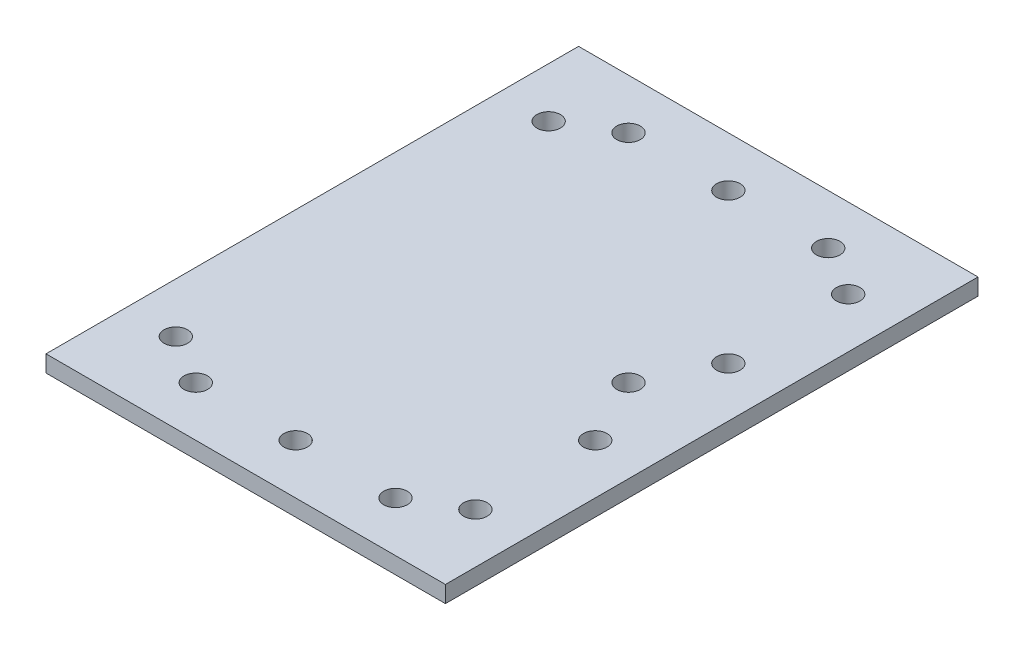
ISO-10303-21;
HEADER;
FILE_DESCRIPTION(('STEP AP214'),'2;1');
FILE_NAME('part.step','',(''),(''),'','','');
FILE_SCHEMA(('AUTOMOTIVE_DESIGN { 1 0 10303 214 1 1 1 1 }'));
ENDSEC;
DATA;
#1=APPLICATION_CONTEXT('core data for automotive mechanical design processes');
#2=APPLICATION_PROTOCOL_DEFINITION('international standard','automotive_design',2000,#1);
#3=PRODUCT_CONTEXT('',#1,'mechanical');
#4=PRODUCT('Part','Part','',(#3));
#5=PRODUCT_RELATED_PRODUCT_CATEGORY('part','',(#4));
#6=PRODUCT_DEFINITION_FORMATION('','',#4);
#7=PRODUCT_DEFINITION_CONTEXT('part definition',#1,'design');
#8=PRODUCT_DEFINITION('design','',#6,#7);
#9=PRODUCT_DEFINITION_SHAPE('','',#8);
#10=(LENGTH_UNIT() NAMED_UNIT(*) SI_UNIT(.MILLI.,.METRE.));
#11=(NAMED_UNIT(*) PLANE_ANGLE_UNIT() SI_UNIT($,.RADIAN.));
#12=(NAMED_UNIT(*) SI_UNIT($,.STERADIAN.) SOLID_ANGLE_UNIT());
#13=UNCERTAINTY_MEASURE_WITH_UNIT(LENGTH_MEASURE(1.E-05),#10,'distance_accuracy_value','');
#14=(GEOMETRIC_REPRESENTATION_CONTEXT(3) GLOBAL_UNCERTAINTY_ASSIGNED_CONTEXT((#13)) GLOBAL_UNIT_ASSIGNED_CONTEXT((#10,
#11,#12)) REPRESENTATION_CONTEXT('',''));
#15=CARTESIAN_POINT('',(0.,0.,0.));
#16=DIRECTION('',(0.,0.,1.));
#17=DIRECTION('',(1.,0.,0.));
#18=AXIS2_PLACEMENT_3D('',#15,#16,#17);
#19=CARTESIAN_POINT('',(0.,3.175,0.));
#20=DIRECTION('',(0.,-1.,0.));
#21=DIRECTION('',(0.,0.,-1.));
#22=AXIS2_PLACEMENT_3D('',#19,#20,#21);
#23=PLANE('',#22);
#24=DIRECTION('',(0.,0.,1.));
#25=VECTOR('',#24,1.);
#26=CARTESIAN_POINT('',(-38.1,3.175,-50.8));
#27=LINE('',#26,#25);
#28=CARTESIAN_POINT('',(-38.1,3.175,-50.8));
#29=VERTEX_POINT('',#28);
#30=CARTESIAN_POINT('',(-38.1,3.175,50.8));
#31=VERTEX_POINT('',#30);
#32=EDGE_CURVE('E89',#29,#31,#27,.T.);
#33=ORIENTED_EDGE('',*,*,#32,.T.);
#34=DIRECTION('',(1.,0.,0.));
#35=VECTOR('',#34,1.);
#36=CARTESIAN_POINT('',(38.1,3.175,50.8));
#37=LINE('',#36,#35);
#38=CARTESIAN_POINT('',(38.1,3.175,50.8));
#39=VERTEX_POINT('',#38);
#40=EDGE_CURVE('E84',#31,#39,#37,.T.);
#41=ORIENTED_EDGE('',*,*,#40,.T.);
#42=DIRECTION('',(0.,0.,-1.));
#43=VECTOR('',#42,1.);
#44=CARTESIAN_POINT('',(38.1,3.175,-50.8));
#45=LINE('',#44,#43);
#46=CARTESIAN_POINT('',(38.1,3.175,-50.8));
#47=VERTEX_POINT('',#46);
#48=EDGE_CURVE('E87',#39,#47,#45,.T.);
#49=ORIENTED_EDGE('',*,*,#48,.T.);
#50=DIRECTION('',(-1.,0.,0.));
#51=VECTOR('',#50,1.);
#52=CARTESIAN_POINT('',(38.1,3.175,-50.8));
#53=LINE('',#52,#51);
#54=EDGE_CURVE('E54',#47,#29,#53,.T.);
#55=ORIENTED_EDGE('',*,*,#54,.T.);
#56=EDGE_LOOP('',(#33,#41,#49,#55));
#57=FACE_BOUND('',#56,.T.);
#58=CARTESIAN_POINT('',(-19.05,3.175,41.275));
#59=DIRECTION('',(0.,1.,0.));
#60=DIRECTION('',(0.,0.,1.));
#61=AXIS2_PLACEMENT_3D('',#58,#59,#60);
#62=CIRCLE('',#61,2.25);
#63=CARTESIAN_POINT('',(-19.05,3.175,43.525));
#64=VERTEX_POINT('',#63);
#65=EDGE_CURVE('E104',#64,#64,#62,.T.);
#66=ORIENTED_EDGE('',*,*,#65,.F.);
#67=EDGE_LOOP('',(#66));
#68=FACE_BOUND('',#67,.T.);
#69=CARTESIAN_POINT('',(19.05,3.175,41.275));
#70=DIRECTION('',(0.,1.,0.));
#71=DIRECTION('',(0.,0.,1.));
#72=AXIS2_PLACEMENT_3D('',#69,#70,#71);
#73=CIRCLE('',#72,2.25);
#74=CARTESIAN_POINT('',(19.05,3.175,43.525));
#75=VERTEX_POINT('',#74);
#76=EDGE_CURVE('E119',#75,#75,#73,.T.);
#77=ORIENTED_EDGE('',*,*,#76,.F.);
#78=EDGE_LOOP('',(#77));
#79=FACE_BOUND('',#78,.T.);
#80=CARTESIAN_POINT('',(28.575,3.175,35.56));
#81=DIRECTION('',(0.,1.,0.));
#82=DIRECTION('',(0.,0.,1.));
#83=AXIS2_PLACEMENT_3D('',#80,#81,#82);
#84=CIRCLE('',#83,2.25);
#85=CARTESIAN_POINT('',(28.575,3.175,37.81));
#86=VERTEX_POINT('',#85);
#87=EDGE_CURVE('E125',#86,#86,#84,.T.);
#88=ORIENTED_EDGE('',*,*,#87,.F.);
#89=EDGE_LOOP('',(#88));
#90=FACE_BOUND('',#89,.T.);
#91=CARTESIAN_POINT('',(-28.575,3.175,35.56));
#92=DIRECTION('',(0.,1.,0.));
#93=DIRECTION('',(0.,0.,1.));
#94=AXIS2_PLACEMENT_3D('',#91,#92,#93);
#95=CIRCLE('',#94,2.25);
#96=CARTESIAN_POINT('',(-28.575,3.175,37.81));
#97=VERTEX_POINT('',#96);
#98=EDGE_CURVE('E131',#97,#97,#95,.T.);
#99=ORIENTED_EDGE('',*,*,#98,.F.);
#100=EDGE_LOOP('',(#99));
#101=FACE_BOUND('',#100,.T.);
#102=CARTESIAN_POINT('',(28.575,3.175,-35.56));
#103=DIRECTION('',(0.,1.,0.));
#104=DIRECTION('',(0.,0.,-1.));
#105=AXIS2_PLACEMENT_3D('',#102,#103,#104);
#106=CIRCLE('',#105,2.25);
#107=CARTESIAN_POINT('',(28.575,3.175,-37.81));
#108=VERTEX_POINT('',#107);
#109=EDGE_CURVE('E137',#108,#108,#106,.T.);
#110=ORIENTED_EDGE('',*,*,#109,.F.);
#111=EDGE_LOOP('',(#110));
#112=FACE_BOUND('',#111,.T.);
#113=CARTESIAN_POINT('',(19.05,3.175,-41.275));
#114=DIRECTION('',(0.,1.,0.));
#115=DIRECTION('',(0.,0.,-1.));
#116=AXIS2_PLACEMENT_3D('',#113,#114,#115);
#117=CIRCLE('',#116,2.25);
#118=CARTESIAN_POINT('',(19.05,3.175,-43.525));
#119=VERTEX_POINT('',#118);
#120=EDGE_CURVE('E143',#119,#119,#117,.T.);
#121=ORIENTED_EDGE('',*,*,#120,.F.);
#122=EDGE_LOOP('',(#121));
#123=FACE_BOUND('',#122,.T.);
#124=CARTESIAN_POINT('',(-28.575,3.175,-35.56));
#125=DIRECTION('',(0.,1.,0.));
#126=DIRECTION('',(0.,0.,-1.));
#127=AXIS2_PLACEMENT_3D('',#124,#125,#126);
#128=CIRCLE('',#127,2.25);
#129=CARTESIAN_POINT('',(-28.575,3.175,-37.81));
#130=VERTEX_POINT('',#129);
#131=EDGE_CURVE('E149',#130,#130,#128,.T.);
#132=ORIENTED_EDGE('',*,*,#131,.F.);
#133=EDGE_LOOP('',(#132));
#134=FACE_BOUND('',#133,.T.);
#135=CARTESIAN_POINT('',(-19.05,3.175,-41.275));
#136=DIRECTION('',(0.,1.,0.));
#137=DIRECTION('',(0.,0.,-1.));
#138=AXIS2_PLACEMENT_3D('',#135,#136,#137);
#139=CIRCLE('',#138,2.25);
#140=CARTESIAN_POINT('',(-19.05,3.175,-43.525));
#141=VERTEX_POINT('',#140);
#142=EDGE_CURVE('E155',#141,#141,#139,.T.);
#143=ORIENTED_EDGE('',*,*,#142,.F.);
#144=EDGE_LOOP('',(#143));
#145=FACE_BOUND('',#144,.T.);
#146=CARTESIAN_POINT('',(0.,3.175,41.275));
#147=DIRECTION('',(0.,1.,0.));
#148=DIRECTION('',(0.,0.,1.));
#149=AXIS2_PLACEMENT_3D('',#146,#147,#148);
#150=CIRCLE('',#149,2.25);
#151=CARTESIAN_POINT('',(0.,3.175,43.525));
#152=VERTEX_POINT('',#151);
#153=EDGE_CURVE('E161',#152,#152,#150,.T.);
#154=ORIENTED_EDGE('',*,*,#153,.F.);
#155=EDGE_LOOP('',(#154));
#156=FACE_BOUND('',#155,.T.);
#157=CARTESIAN_POINT('',(0.,3.175,-41.275));
#158=DIRECTION('',(0.,1.,0.));
#159=DIRECTION('',(0.,0.,-1.));
#160=AXIS2_PLACEMENT_3D('',#157,#158,#159);
#161=CIRCLE('',#160,2.25);
#162=CARTESIAN_POINT('',(0.,3.175,-43.525));
#163=VERTEX_POINT('',#162);
#164=EDGE_CURVE('E167',#163,#163,#161,.T.);
#165=ORIENTED_EDGE('',*,*,#164,.F.);
#166=EDGE_LOOP('',(#165));
#167=FACE_BOUND('',#166,.T.);
#168=CARTESIAN_POINT('',(28.575,3.175,-12.7));
#169=DIRECTION('',(0.,1.,0.));
#170=DIRECTION('',(0.,0.,1.));
#171=AXIS2_PLACEMENT_3D('',#168,#169,#170);
#172=CIRCLE('',#171,2.25);
#173=CARTESIAN_POINT('',(28.575,3.175,-10.45));
#174=VERTEX_POINT('',#173);
#175=EDGE_CURVE('E173',#174,#174,#172,.T.);
#176=ORIENTED_EDGE('',*,*,#175,.F.);
#177=EDGE_LOOP('',(#176));
#178=FACE_BOUND('',#177,.T.);
#179=CARTESIAN_POINT('',(28.575,3.175,12.7));
#180=DIRECTION('',(0.,1.,0.));
#181=DIRECTION('',(0.,0.,1.));
#182=AXIS2_PLACEMENT_3D('',#179,#180,#181);
#183=CIRCLE('',#182,2.25);
#184=CARTESIAN_POINT('',(28.575,3.175,14.95));
#185=VERTEX_POINT('',#184);
#186=EDGE_CURVE('E179',#185,#185,#183,.T.);
#187=ORIENTED_EDGE('',*,*,#186,.F.);
#188=EDGE_LOOP('',(#187));
#189=FACE_BOUND('',#188,.T.);
#190=CARTESIAN_POINT('',(22.23,3.175,0.));
#191=DIRECTION('',(0.,1.,0.));
#192=DIRECTION('',(0.,0.,1.));
#193=AXIS2_PLACEMENT_3D('',#190,#191,#192);
#194=CIRCLE('',#193,2.24999999999998);
#195=CARTESIAN_POINT('',(22.23,3.175,2.25));
#196=VERTEX_POINT('',#195);
#197=EDGE_CURVE('E185',#196,#196,#194,.T.);
#198=ORIENTED_EDGE('',*,*,#197,.F.);
#199=EDGE_LOOP('',(#198));
#200=FACE_BOUND('',#199,.T.);
#201=ADVANCED_FACE('F37',(#57,#68,#79,#90,#101,#112,#123,#134,#145,#156,#167,#178,#189,#200),
#23,.F.);
#202=CARTESIAN_POINT('',(0.,0.,0.));
#203=DIRECTION('',(0.,-1.,0.));
#204=DIRECTION('',(0.,0.,-1.));
#205=AXIS2_PLACEMENT_3D('',#202,#203,#204);
#206=PLANE('',#205);
#207=CARTESIAN_POINT('',(28.575,0.,12.7));
#208=DIRECTION('',(0.,1.,0.));
#209=DIRECTION('',(0.,0.,1.));
#210=AXIS2_PLACEMENT_3D('',#207,#208,#209);
#211=CIRCLE('',#210,2.25);
#212=CARTESIAN_POINT('',(28.575,0.,14.95));
#213=VERTEX_POINT('',#212);
#214=EDGE_CURVE('E182',#213,#213,#211,.T.);
#215=ORIENTED_EDGE('',*,*,#214,.T.);
#216=EDGE_LOOP('',(#215));
#217=FACE_BOUND('',#216,.T.);
#218=CARTESIAN_POINT('',(0.,0.,-41.275));
#219=DIRECTION('',(0.,1.,0.));
#220=DIRECTION('',(0.,0.,-1.));
#221=AXIS2_PLACEMENT_3D('',#218,#219,#220);
#222=CIRCLE('',#221,2.25);
#223=CARTESIAN_POINT('',(0.,0.,-43.525));
#224=VERTEX_POINT('',#223);
#225=EDGE_CURVE('E170',#224,#224,#222,.T.);
#226=ORIENTED_EDGE('',*,*,#225,.T.);
#227=EDGE_LOOP('',(#226));
#228=FACE_BOUND('',#227,.T.);
#229=CARTESIAN_POINT('',(-19.05,0.,-41.275));
#230=DIRECTION('',(0.,1.,0.));
#231=DIRECTION('',(0.,0.,-1.));
#232=AXIS2_PLACEMENT_3D('',#229,#230,#231);
#233=CIRCLE('',#232,2.25);
#234=CARTESIAN_POINT('',(-19.05,0.,-43.525));
#235=VERTEX_POINT('',#234);
#236=EDGE_CURVE('E158',#235,#235,#233,.T.);
#237=ORIENTED_EDGE('',*,*,#236,.T.);
#238=EDGE_LOOP('',(#237));
#239=FACE_BOUND('',#238,.T.);
#240=CARTESIAN_POINT('',(19.05,0.,-41.275));
#241=DIRECTION('',(0.,1.,0.));
#242=DIRECTION('',(0.,0.,-1.));
#243=AXIS2_PLACEMENT_3D('',#240,#241,#242);
#244=CIRCLE('',#243,2.25);
#245=CARTESIAN_POINT('',(19.05,0.,-43.525));
#246=VERTEX_POINT('',#245);
#247=EDGE_CURVE('E146',#246,#246,#244,.T.);
#248=ORIENTED_EDGE('',*,*,#247,.T.);
#249=EDGE_LOOP('',(#248));
#250=FACE_BOUND('',#249,.T.);
#251=CARTESIAN_POINT('',(-28.575,0.,35.56));
#252=DIRECTION('',(0.,1.,0.));
#253=DIRECTION('',(0.,0.,1.));
#254=AXIS2_PLACEMENT_3D('',#251,#252,#253);
#255=CIRCLE('',#254,2.25);
#256=CARTESIAN_POINT('',(-28.575,0.,37.81));
#257=VERTEX_POINT('',#256);
#258=EDGE_CURVE('E134',#257,#257,#255,.T.);
#259=ORIENTED_EDGE('',*,*,#258,.T.);
#260=EDGE_LOOP('',(#259));
#261=FACE_BOUND('',#260,.T.);
#262=CARTESIAN_POINT('',(19.05,0.,41.275));
#263=DIRECTION('',(0.,1.,0.));
#264=DIRECTION('',(0.,0.,1.));
#265=AXIS2_PLACEMENT_3D('',#262,#263,#264);
#266=CIRCLE('',#265,2.25);
#267=CARTESIAN_POINT('',(19.05,0.,43.525));
#268=VERTEX_POINT('',#267);
#269=EDGE_CURVE('E122',#268,#268,#266,.T.);
#270=ORIENTED_EDGE('',*,*,#269,.T.);
#271=EDGE_LOOP('',(#270));
#272=FACE_BOUND('',#271,.T.);
#273=DIRECTION('',(0.,0.,1.));
#274=VECTOR('',#273,1.);
#275=CARTESIAN_POINT('',(-38.1,0.,-50.8));
#276=LINE('',#275,#274);
#277=CARTESIAN_POINT('',(-38.1,0.,-50.8));
#278=VERTEX_POINT('',#277);
#279=CARTESIAN_POINT('',(-38.1,0.,50.8));
#280=VERTEX_POINT('',#279);
#281=EDGE_CURVE('E101',#278,#280,#276,.T.);
#282=ORIENTED_EDGE('',*,*,#281,.F.);
#283=DIRECTION('',(-1.,0.,0.));
#284=VECTOR('',#283,1.);
#285=CARTESIAN_POINT('',(38.1,0.,-50.8));
#286=LINE('',#285,#284);
#287=CARTESIAN_POINT('',(38.1,0.,-50.8));
#288=VERTEX_POINT('',#287);
#289=EDGE_CURVE('E77',#288,#278,#286,.T.);
#290=ORIENTED_EDGE('',*,*,#289,.F.);
#291=DIRECTION('',(0.,0.,-1.));
#292=VECTOR('',#291,1.);
#293=CARTESIAN_POINT('',(38.1,0.,-50.8));
#294=LINE('',#293,#292);
#295=CARTESIAN_POINT('',(38.1,0.,50.8));
#296=VERTEX_POINT('',#295);
#297=EDGE_CURVE('E71',#296,#288,#294,.T.);
#298=ORIENTED_EDGE('',*,*,#297,.F.);
#299=DIRECTION('',(1.,0.,0.));
#300=VECTOR('',#299,1.);
#301=CARTESIAN_POINT('',(38.1,0.,50.8));
#302=LINE('',#301,#300);
#303=EDGE_CURVE('E93',#280,#296,#302,.T.);
#304=ORIENTED_EDGE('',*,*,#303,.F.);
#305=EDGE_LOOP('',(#282,#290,#298,#304));
#306=FACE_BOUND('',#305,.T.);
#307=CARTESIAN_POINT('',(-19.05,0.,41.275));
#308=DIRECTION('',(0.,1.,0.));
#309=DIRECTION('',(0.,0.,1.));
#310=AXIS2_PLACEMENT_3D('',#307,#308,#309);
#311=CIRCLE('',#310,2.25);
#312=CARTESIAN_POINT('',(-19.05,0.,43.525));
#313=VERTEX_POINT('',#312);
#314=EDGE_CURVE('E116',#313,#313,#311,.T.);
#315=ORIENTED_EDGE('',*,*,#314,.T.);
#316=EDGE_LOOP('',(#315));
#317=FACE_BOUND('',#316,.T.);
#318=CARTESIAN_POINT('',(28.575,0.,35.56));
#319=DIRECTION('',(0.,1.,0.));
#320=DIRECTION('',(0.,0.,1.));
#321=AXIS2_PLACEMENT_3D('',#318,#319,#320);
#322=CIRCLE('',#321,2.25);
#323=CARTESIAN_POINT('',(28.575,0.,37.81));
#324=VERTEX_POINT('',#323);
#325=EDGE_CURVE('E128',#324,#324,#322,.T.);
#326=ORIENTED_EDGE('',*,*,#325,.T.);
#327=EDGE_LOOP('',(#326));
#328=FACE_BOUND('',#327,.T.);
#329=CARTESIAN_POINT('',(28.575,0.,-35.56));
#330=DIRECTION('',(0.,1.,0.));
#331=DIRECTION('',(0.,0.,-1.));
#332=AXIS2_PLACEMENT_3D('',#329,#330,#331);
#333=CIRCLE('',#332,2.25);
#334=CARTESIAN_POINT('',(28.575,0.,-37.81));
#335=VERTEX_POINT('',#334);
#336=EDGE_CURVE('E140',#335,#335,#333,.T.);
#337=ORIENTED_EDGE('',*,*,#336,.T.);
#338=EDGE_LOOP('',(#337));
#339=FACE_BOUND('',#338,.T.);
#340=CARTESIAN_POINT('',(-28.575,0.,-35.56));
#341=DIRECTION('',(0.,1.,0.));
#342=DIRECTION('',(0.,0.,-1.));
#343=AXIS2_PLACEMENT_3D('',#340,#341,#342);
#344=CIRCLE('',#343,2.25);
#345=CARTESIAN_POINT('',(-28.575,0.,-37.81));
#346=VERTEX_POINT('',#345);
#347=EDGE_CURVE('E152',#346,#346,#344,.T.);
#348=ORIENTED_EDGE('',*,*,#347,.T.);
#349=EDGE_LOOP('',(#348));
#350=FACE_BOUND('',#349,.T.);
#351=CARTESIAN_POINT('',(0.,0.,41.275));
#352=DIRECTION('',(0.,1.,0.));
#353=DIRECTION('',(0.,0.,1.));
#354=AXIS2_PLACEMENT_3D('',#351,#352,#353);
#355=CIRCLE('',#354,2.25);
#356=CARTESIAN_POINT('',(0.,0.,43.525));
#357=VERTEX_POINT('',#356);
#358=EDGE_CURVE('E164',#357,#357,#355,.T.);
#359=ORIENTED_EDGE('',*,*,#358,.T.);
#360=EDGE_LOOP('',(#359));
#361=FACE_BOUND('',#360,.T.);
#362=CARTESIAN_POINT('',(28.575,0.,-12.7));
#363=DIRECTION('',(0.,1.,0.));
#364=DIRECTION('',(0.,0.,1.));
#365=AXIS2_PLACEMENT_3D('',#362,#363,#364);
#366=CIRCLE('',#365,2.25);
#367=CARTESIAN_POINT('',(28.575,0.,-10.45));
#368=VERTEX_POINT('',#367);
#369=EDGE_CURVE('E176',#368,#368,#366,.T.);
#370=ORIENTED_EDGE('',*,*,#369,.T.);
#371=EDGE_LOOP('',(#370));
#372=FACE_BOUND('',#371,.T.);
#373=CARTESIAN_POINT('',(22.23,0.,0.));
#374=DIRECTION('',(0.,1.,0.));
#375=DIRECTION('',(0.,0.,1.));
#376=AXIS2_PLACEMENT_3D('',#373,#374,#375);
#377=CIRCLE('',#376,2.24999999999998);
#378=CARTESIAN_POINT('',(22.23,0.,2.25));
#379=VERTEX_POINT('',#378);
#380=EDGE_CURVE('E188',#379,#379,#377,.T.);
#381=ORIENTED_EDGE('',*,*,#380,.T.);
#382=EDGE_LOOP('',(#381));
#383=FACE_BOUND('',#382,.T.);
#384=ADVANCED_FACE('F112',(#217,#228,#239,#250,#261,#272,#306,#317,#328,#339,#350,#361,#372,
#383),#206,.T.);
#385=CARTESIAN_POINT('',(-38.1,3.175,-50.8));
#386=DIRECTION('',(1.,0.,0.));
#387=DIRECTION('',(0.,0.,-1.));
#388=AXIS2_PLACEMENT_3D('',#385,#386,#387);
#389=PLANE('',#388);
#390=ORIENTED_EDGE('',*,*,#281,.T.);
#391=DIRECTION('',(0.,-1.,0.));
#392=VECTOR('',#391,1.);
#393=CARTESIAN_POINT('',(-38.1,3.175,50.8));
#394=LINE('',#393,#392);
#395=EDGE_CURVE('E11',#31,#280,#394,.T.);
#396=ORIENTED_EDGE('',*,*,#395,.F.);
#397=ORIENTED_EDGE('',*,*,#32,.F.);
#398=DIRECTION('',(0.,-1.,0.));
#399=VECTOR('',#398,1.);
#400=CARTESIAN_POINT('',(-38.1,3.175,-50.8));
#401=LINE('',#400,#399);
#402=EDGE_CURVE('E97',#29,#278,#401,.T.);
#403=ORIENTED_EDGE('',*,*,#402,.T.);
#404=EDGE_LOOP('',(#390,#396,#397,#403));
#405=FACE_BOUND('',#404,.T.);
#406=ADVANCED_FACE('F39',(#405),#389,.F.);
#407=CARTESIAN_POINT('',(38.1,3.175,50.8));
#408=DIRECTION('',(0.,0.,-1.));
#409=DIRECTION('',(-1.,0.,0.));
#410=AXIS2_PLACEMENT_3D('',#407,#408,#409);
#411=PLANE('',#410);
#412=ORIENTED_EDGE('',*,*,#303,.T.);
#413=DIRECTION('',(0.,-1.,0.));
#414=VECTOR('',#413,1.);
#415=CARTESIAN_POINT('',(38.1,3.175,50.8));
#416=LINE('',#415,#414);
#417=EDGE_CURVE('E46',#39,#296,#416,.T.);
#418=ORIENTED_EDGE('',*,*,#417,.F.);
#419=ORIENTED_EDGE('',*,*,#40,.F.);
#420=ORIENTED_EDGE('',*,*,#395,.T.);
#421=EDGE_LOOP('',(#412,#418,#419,#420));
#422=FACE_BOUND('',#421,.T.);
#423=ADVANCED_FACE('F92',(#422),#411,.F.);
#424=CARTESIAN_POINT('',(38.1,3.175,-50.8));
#425=DIRECTION('',(-1.,0.,0.));
#426=DIRECTION('',(0.,0.,1.));
#427=AXIS2_PLACEMENT_3D('',#424,#425,#426);
#428=PLANE('',#427);
#429=ORIENTED_EDGE('',*,*,#297,.T.);
#430=DIRECTION('',(0.,-1.,0.));
#431=VECTOR('',#430,1.);
#432=CARTESIAN_POINT('',(38.1,3.175,-50.8));
#433=LINE('',#432,#431);
#434=EDGE_CURVE('E94',#47,#288,#433,.T.);
#435=ORIENTED_EDGE('',*,*,#434,.F.);
#436=ORIENTED_EDGE('',*,*,#48,.F.);
#437=ORIENTED_EDGE('',*,*,#417,.T.);
#438=EDGE_LOOP('',(#429,#435,#436,#437));
#439=FACE_BOUND('',#438,.T.);
#440=ADVANCED_FACE('F95',(#439),#428,.F.);
#441=CARTESIAN_POINT('',(38.1,3.175,-50.8));
#442=DIRECTION('',(0.,0.,1.));
#443=DIRECTION('',(1.,0.,0.));
#444=AXIS2_PLACEMENT_3D('',#441,#442,#443);
#445=PLANE('',#444);
#446=ORIENTED_EDGE('',*,*,#289,.T.);
#447=ORIENTED_EDGE('',*,*,#402,.F.);
#448=ORIENTED_EDGE('',*,*,#54,.F.);
#449=ORIENTED_EDGE('',*,*,#434,.T.);
#450=EDGE_LOOP('',(#446,#447,#448,#449));
#451=FACE_BOUND('',#450,.T.);
#452=ADVANCED_FACE('F109',(#451),#445,.F.);
#453=CARTESIAN_POINT('',(-19.05,3.175,41.275));
#454=DIRECTION('',(0.,-1.,0.));
#455=DIRECTION('',(0.,0.,-1.));
#456=AXIS2_PLACEMENT_3D('',#453,#454,#455);
#457=CYLINDRICAL_SURFACE('',#456,2.25);
#458=ORIENTED_EDGE('',*,*,#65,.T.);
#459=EDGE_LOOP('',(#458));
#460=FACE_BOUND('',#459,.T.);
#461=ORIENTED_EDGE('',*,*,#314,.F.);
#462=EDGE_LOOP('',(#461));
#463=FACE_BOUND('',#462,.T.);
#464=ADVANCED_FACE('F205',(#460,#463),#457,.F.);
#465=CARTESIAN_POINT('',(19.05,3.175,41.275));
#466=DIRECTION('',(0.,-1.,0.));
#467=DIRECTION('',(0.,0.,-1.));
#468=AXIS2_PLACEMENT_3D('',#465,#466,#467);
#469=CYLINDRICAL_SURFACE('',#468,2.25);
#470=ORIENTED_EDGE('',*,*,#76,.T.);
#471=EDGE_LOOP('',(#470));
#472=FACE_BOUND('',#471,.T.);
#473=ORIENTED_EDGE('',*,*,#269,.F.);
#474=EDGE_LOOP('',(#473));
#475=FACE_BOUND('',#474,.T.);
#476=ADVANCED_FACE('F259',(#472,#475),#469,.F.);
#477=CARTESIAN_POINT('',(28.575,3.175,35.56));
#478=DIRECTION('',(0.,-1.,0.));
#479=DIRECTION('',(0.,0.,-1.));
#480=AXIS2_PLACEMENT_3D('',#477,#478,#479);
#481=CYLINDRICAL_SURFACE('',#480,2.25);
#482=ORIENTED_EDGE('',*,*,#87,.T.);
#483=EDGE_LOOP('',(#482));
#484=FACE_BOUND('',#483,.T.);
#485=ORIENTED_EDGE('',*,*,#325,.F.);
#486=EDGE_LOOP('',(#485));
#487=FACE_BOUND('',#486,.T.);
#488=ADVANCED_FACE('F268',(#484,#487),#481,.F.);
#489=CARTESIAN_POINT('',(-28.575,3.175,35.56));
#490=DIRECTION('',(0.,-1.,0.));
#491=DIRECTION('',(0.,0.,-1.));
#492=AXIS2_PLACEMENT_3D('',#489,#490,#491);
#493=CYLINDRICAL_SURFACE('',#492,2.25);
#494=ORIENTED_EDGE('',*,*,#98,.T.);
#495=EDGE_LOOP('',(#494));
#496=FACE_BOUND('',#495,.T.);
#497=ORIENTED_EDGE('',*,*,#258,.F.);
#498=EDGE_LOOP('',(#497));
#499=FACE_BOUND('',#498,.T.);
#500=ADVANCED_FACE('F277',(#496,#499),#493,.F.);
#501=CARTESIAN_POINT('',(28.575,3.175,-35.56));
#502=DIRECTION('',(0.,-1.,0.));
#503=DIRECTION('',(0.,0.,-1.));
#504=AXIS2_PLACEMENT_3D('',#501,#502,#503);
#505=CYLINDRICAL_SURFACE('',#504,2.25);
#506=ORIENTED_EDGE('',*,*,#109,.T.);
#507=EDGE_LOOP('',(#506));
#508=FACE_BOUND('',#507,.T.);
#509=ORIENTED_EDGE('',*,*,#336,.F.);
#510=EDGE_LOOP('',(#509));
#511=FACE_BOUND('',#510,.T.);
#512=ADVANCED_FACE('F287',(#508,#511),#505,.F.);
#513=CARTESIAN_POINT('',(19.05,3.175,-41.275));
#514=DIRECTION('',(0.,-1.,0.));
#515=DIRECTION('',(0.,0.,-1.));
#516=AXIS2_PLACEMENT_3D('',#513,#514,#515);
#517=CYLINDRICAL_SURFACE('',#516,2.25);
#518=ORIENTED_EDGE('',*,*,#120,.T.);
#519=EDGE_LOOP('',(#518));
#520=FACE_BOUND('',#519,.T.);
#521=ORIENTED_EDGE('',*,*,#247,.F.);
#522=EDGE_LOOP('',(#521));
#523=FACE_BOUND('',#522,.T.);
#524=ADVANCED_FACE('F297',(#520,#523),#517,.F.);
#525=CARTESIAN_POINT('',(-28.575,3.175,-35.56));
#526=DIRECTION('',(0.,-1.,0.));
#527=DIRECTION('',(0.,0.,-1.));
#528=AXIS2_PLACEMENT_3D('',#525,#526,#527);
#529=CYLINDRICAL_SURFACE('',#528,2.25);
#530=ORIENTED_EDGE('',*,*,#131,.T.);
#531=EDGE_LOOP('',(#530));
#532=FACE_BOUND('',#531,.T.);
#533=ORIENTED_EDGE('',*,*,#347,.F.);
#534=EDGE_LOOP('',(#533));
#535=FACE_BOUND('',#534,.T.);
#536=ADVANCED_FACE('F307',(#532,#535),#529,.F.);
#537=CARTESIAN_POINT('',(-19.05,3.175,-41.275));
#538=DIRECTION('',(0.,-1.,0.));
#539=DIRECTION('',(0.,0.,-1.));
#540=AXIS2_PLACEMENT_3D('',#537,#538,#539);
#541=CYLINDRICAL_SURFACE('',#540,2.25);
#542=ORIENTED_EDGE('',*,*,#142,.T.);
#543=EDGE_LOOP('',(#542));
#544=FACE_BOUND('',#543,.T.);
#545=ORIENTED_EDGE('',*,*,#236,.F.);
#546=EDGE_LOOP('',(#545));
#547=FACE_BOUND('',#546,.T.);
#548=ADVANCED_FACE('F317',(#544,#547),#541,.F.);
#549=CARTESIAN_POINT('',(0.,3.175,41.275));
#550=DIRECTION('',(0.,-1.,0.));
#551=DIRECTION('',(0.,0.,-1.));
#552=AXIS2_PLACEMENT_3D('',#549,#550,#551);
#553=CYLINDRICAL_SURFACE('',#552,2.25);
#554=ORIENTED_EDGE('',*,*,#153,.T.);
#555=EDGE_LOOP('',(#554));
#556=FACE_BOUND('',#555,.T.);
#557=ORIENTED_EDGE('',*,*,#358,.F.);
#558=EDGE_LOOP('',(#557));
#559=FACE_BOUND('',#558,.T.);
#560=ADVANCED_FACE('F327',(#556,#559),#553,.F.);
#561=CARTESIAN_POINT('',(0.,3.175,-41.275));
#562=DIRECTION('',(0.,-1.,0.));
#563=DIRECTION('',(0.,0.,-1.));
#564=AXIS2_PLACEMENT_3D('',#561,#562,#563);
#565=CYLINDRICAL_SURFACE('',#564,2.25);
#566=ORIENTED_EDGE('',*,*,#164,.T.);
#567=EDGE_LOOP('',(#566));
#568=FACE_BOUND('',#567,.T.);
#569=ORIENTED_EDGE('',*,*,#225,.F.);
#570=EDGE_LOOP('',(#569));
#571=FACE_BOUND('',#570,.T.);
#572=ADVANCED_FACE('F337',(#568,#571),#565,.F.);
#573=CARTESIAN_POINT('',(28.575,3.175,-12.7));
#574=DIRECTION('',(0.,-1.,0.));
#575=DIRECTION('',(0.,0.,-1.));
#576=AXIS2_PLACEMENT_3D('',#573,#574,#575);
#577=CYLINDRICAL_SURFACE('',#576,2.25);
#578=ORIENTED_EDGE('',*,*,#175,.T.);
#579=EDGE_LOOP('',(#578));
#580=FACE_BOUND('',#579,.T.);
#581=ORIENTED_EDGE('',*,*,#369,.F.);
#582=EDGE_LOOP('',(#581));
#583=FACE_BOUND('',#582,.T.);
#584=ADVANCED_FACE('F347',(#580,#583),#577,.F.);
#585=CARTESIAN_POINT('',(28.575,3.175,12.7));
#586=DIRECTION('',(0.,-1.,0.));
#587=DIRECTION('',(0.,0.,-1.));
#588=AXIS2_PLACEMENT_3D('',#585,#586,#587);
#589=CYLINDRICAL_SURFACE('',#588,2.25);
#590=ORIENTED_EDGE('',*,*,#186,.T.);
#591=EDGE_LOOP('',(#590));
#592=FACE_BOUND('',#591,.T.);
#593=ORIENTED_EDGE('',*,*,#214,.F.);
#594=EDGE_LOOP('',(#593));
#595=FACE_BOUND('',#594,.T.);
#596=ADVANCED_FACE('F357',(#592,#595),#589,.F.);
#597=CARTESIAN_POINT('',(22.23,3.175,0.));
#598=DIRECTION('',(0.,-1.,0.));
#599=DIRECTION('',(0.,0.,-1.));
#600=AXIS2_PLACEMENT_3D('',#597,#598,#599);
#601=CYLINDRICAL_SURFACE('',#600,2.24999999999998);
#602=ORIENTED_EDGE('',*,*,#197,.T.);
#603=EDGE_LOOP('',(#602));
#604=FACE_BOUND('',#603,.T.);
#605=ORIENTED_EDGE('',*,*,#380,.F.);
#606=EDGE_LOOP('',(#605));
#607=FACE_BOUND('',#606,.T.);
#608=ADVANCED_FACE('F194',(#604,#607),#601,.F.);
#609=CLOSED_SHELL('',(#201,#384,#406,#423,#440,#452,#464,#476,#488,#500,#512,#524,#536,#548,
#560,#572,#584,#596,#608));
#610=MANIFOLD_SOLID_BREP('B2',#609);
#611=ADVANCED_BREP_SHAPE_REPRESENTATION('',(#18,#610),#14);
#612=SHAPE_DEFINITION_REPRESENTATION(#9,#611);
ENDSEC;
END-ISO-10303-21;
